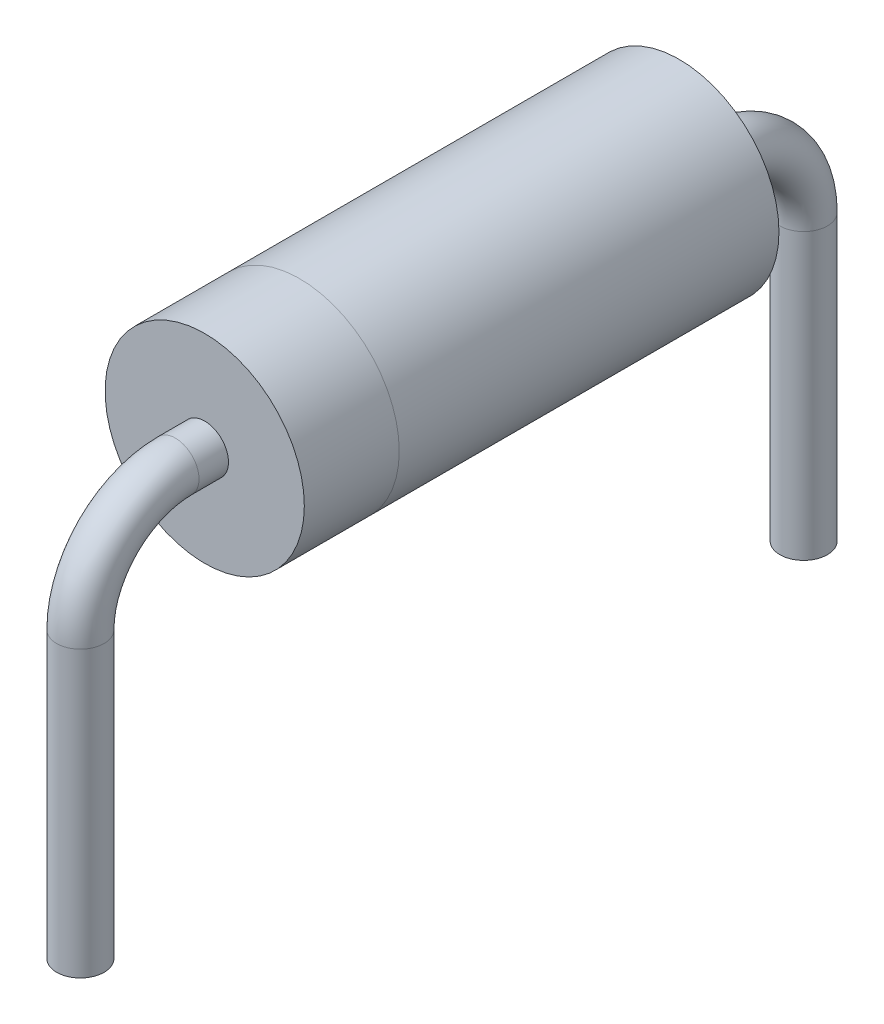
ISO-10303-21;
HEADER;
FILE_DESCRIPTION(('STEP AP214'),'2;1');
FILE_NAME('part.step','',(''),(''),'','','');
FILE_SCHEMA(('AUTOMOTIVE_DESIGN { 1 0 10303 214 1 1 1 1 }'));
ENDSEC;
DATA;
#1=APPLICATION_CONTEXT('core data for automotive mechanical design processes');
#2=APPLICATION_PROTOCOL_DEFINITION('international standard','automotive_design',2000,#1);
#3=PRODUCT_CONTEXT('',#1,'mechanical');
#4=PRODUCT('Part','Part','',(#3));
#5=PRODUCT_RELATED_PRODUCT_CATEGORY('part','',(#4));
#6=PRODUCT_DEFINITION_FORMATION('','',#4);
#7=PRODUCT_DEFINITION_CONTEXT('part definition',#1,'design');
#8=PRODUCT_DEFINITION('design','',#6,#7);
#9=PRODUCT_DEFINITION_SHAPE('','',#8);
#10=(LENGTH_UNIT() NAMED_UNIT(*) SI_UNIT(.MILLI.,.METRE.));
#11=(NAMED_UNIT(*) PLANE_ANGLE_UNIT() SI_UNIT($,.RADIAN.));
#12=(NAMED_UNIT(*) SI_UNIT($,.STERADIAN.) SOLID_ANGLE_UNIT());
#13=UNCERTAINTY_MEASURE_WITH_UNIT(LENGTH_MEASURE(1.E-05),#10,'distance_accuracy_value','');
#14=(GEOMETRIC_REPRESENTATION_CONTEXT(3) GLOBAL_UNCERTAINTY_ASSIGNED_CONTEXT((#13)) GLOBAL_UNIT_ASSIGNED_CONTEXT((#10,
#11,#12)) REPRESENTATION_CONTEXT('',''));
#15=CARTESIAN_POINT('',(0.,0.,0.));
#16=DIRECTION('',(0.,0.,1.));
#17=DIRECTION('',(1.,0.,0.));
#18=AXIS2_PLACEMENT_3D('',#15,#16,#17);
#19=CARTESIAN_POINT('',(0.,0.,5.));
#20=DIRECTION('',(0.,0.,1.));
#21=DIRECTION('',(1.,0.,0.));
#22=AXIS2_PLACEMENT_3D('',#19,#20,#21);
#23=PLANE('',#22);
#24=CARTESIAN_POINT('',(0.,0.,5.));
#25=DIRECTION('',(0.,0.,1.));
#26=DIRECTION('',(1.,0.,0.));
#27=AXIS2_PLACEMENT_3D('',#24,#25,#26);
#28=CIRCLE('',#27,1.0495);
#29=CARTESIAN_POINT('',(1.0495,0.,5.));
#30=VERTEX_POINT('',#29);
#31=EDGE_CURVE('E47',#30,#30,#28,.T.);
#32=ORIENTED_EDGE('',*,*,#31,.T.);
#33=EDGE_LOOP('',(#32));
#34=FACE_BOUND('',#33,.T.);
#35=CARTESIAN_POINT('',(0.,0.,5.));
#36=DIRECTION('',(0.,0.,1.));
#37=DIRECTION('',(1.,0.,0.));
#38=AXIS2_PLACEMENT_3D('',#35,#36,#37);
#39=CIRCLE('',#38,0.25);
#40=CARTESIAN_POINT('',(0.25,0.,5.));
#41=VERTEX_POINT('',#40);
#42=EDGE_CURVE('E100',#41,#41,#39,.T.);
#43=ORIENTED_EDGE('',*,*,#42,.F.);
#44=EDGE_LOOP('',(#43));
#45=FACE_BOUND('',#44,.T.);
#46=ADVANCED_FACE('F32',(#34,#45),#23,.T.);
#47=CARTESIAN_POINT('',(0.,0.,4.));
#48=DIRECTION('',(0.,0.,-1.));
#49=DIRECTION('',(-1.,0.,0.));
#50=AXIS2_PLACEMENT_3D('',#47,#48,#49);
#51=CYLINDRICAL_SURFACE('',#50,1.05);
#52=CARTESIAN_POINT('',(0.,0.,4.));
#53=DIRECTION('',(0.,0.,1.));
#54=DIRECTION('',(1.,0.,0.));
#55=AXIS2_PLACEMENT_3D('',#52,#53,#54);
#56=CIRCLE('',#55,1.0495);
#57=CARTESIAN_POINT('',(1.0495,0.,4.));
#58=VERTEX_POINT('',#57);
#59=EDGE_CURVE('E10',#58,#58,#56,.T.);
#60=ORIENTED_EDGE('',*,*,#59,.F.);
#61=EDGE_LOOP('',(#60));
#62=FACE_BOUND('',#61,.T.);
#63=CARTESIAN_POINT('',(0.,0.,0.));
#64=DIRECTION('',(0.,0.,1.));
#65=DIRECTION('',(1.,0.,0.));
#66=AXIS2_PLACEMENT_3D('',#63,#64,#65);
#67=CIRCLE('',#66,1.05);
#68=CARTESIAN_POINT('',(1.05,0.,0.));
#69=VERTEX_POINT('',#68);
#70=EDGE_CURVE('E42',#69,#69,#67,.T.);
#71=ORIENTED_EDGE('',*,*,#70,.T.);
#72=EDGE_LOOP('',(#71));
#73=FACE_BOUND('',#72,.T.);
#74=ADVANCED_FACE('F34',(#62,#73),#51,.T.);
#75=CARTESIAN_POINT('',(0.,0.,0.));
#76=DIRECTION('',(0.,0.,1.));
#77=DIRECTION('',(1.,0.,0.));
#78=AXIS2_PLACEMENT_3D('',#75,#76,#77);
#79=PLANE('',#78);
#80=CARTESIAN_POINT('',(0.,0.,0.));
#81=DIRECTION('',(0.,0.,1.));
#82=DIRECTION('',(1.,0.,0.));
#83=AXIS2_PLACEMENT_3D('',#80,#81,#82);
#84=CIRCLE('',#83,0.25);
#85=CARTESIAN_POINT('',(0.25,0.,0.));
#86=VERTEX_POINT('',#85);
#87=EDGE_CURVE('E112',#86,#86,#84,.T.);
#88=ORIENTED_EDGE('',*,*,#87,.T.);
#89=EDGE_LOOP('',(#88));
#90=FACE_BOUND('',#89,.T.);
#91=ORIENTED_EDGE('',*,*,#70,.F.);
#92=EDGE_LOOP('',(#91));
#93=FACE_BOUND('',#92,.T.);
#94=ADVANCED_FACE('F60',(#90,#93),#79,.F.);
#95=CARTESIAN_POINT('',(0.,0.,5.));
#96=DIRECTION('',(0.,0.,-1.));
#97=DIRECTION('',(-1.,0.,0.));
#98=AXIS2_PLACEMENT_3D('',#95,#96,#97);
#99=CYLINDRICAL_SURFACE('',#98,1.0495);
#100=ORIENTED_EDGE('',*,*,#31,.F.);
#101=EDGE_LOOP('',(#100));
#102=FACE_BOUND('',#101,.T.);
#103=ORIENTED_EDGE('',*,*,#59,.T.);
#104=EDGE_LOOP('',(#103));
#105=FACE_BOUND('',#104,.T.);
#106=ADVANCED_FACE('F65',(#102,#105),#99,.T.);
#107=CARTESIAN_POINT('',(0.,-1.,6.31));
#108=DIRECTION('',(0.,-1.,0.));
#109=DIRECTION('',(0.,0.,-1.));
#110=AXIS2_PLACEMENT_3D('',#107,#108,#109);
#111=CYLINDRICAL_SURFACE('',#110,0.25);
#112=CARTESIAN_POINT('',(0.,-1.,6.31));
#113=DIRECTION('',(0.,-1.,0.));
#114=DIRECTION('',(1.,0.,0.));
#115=AXIS2_PLACEMENT_3D('',#112,#113,#114);
#116=CIRCLE('',#115,0.25);
#117=CARTESIAN_POINT('',(0.,-1.,6.56));
#118=VERTEX_POINT('',#117);
#119=EDGE_CURVE('E92',#118,#118,#116,.T.);
#120=ORIENTED_EDGE('',*,*,#119,.T.);
#121=EDGE_LOOP('',(#120));
#122=FACE_BOUND('',#121,.T.);
#123=CARTESIAN_POINT('',(0.,-4.,6.31));
#124=DIRECTION('',(0.,-1.,0.));
#125=DIRECTION('',(1.,0.,0.));
#126=AXIS2_PLACEMENT_3D('',#123,#124,#125);
#127=CIRCLE('',#126,0.25);
#128=CARTESIAN_POINT('',(0.25,-4.,6.31));
#129=VERTEX_POINT('',#128);
#130=EDGE_CURVE('E52',#129,#129,#127,.T.);
#131=ORIENTED_EDGE('',*,*,#130,.F.);
#132=EDGE_LOOP('',(#131));
#133=FACE_BOUND('',#132,.T.);
#134=ADVANCED_FACE('F73',(#122,#133),#111,.T.);
#135=CARTESIAN_POINT('',(0.,-1.,5.31));
#136=DIRECTION('',(1.,0.,0.));
#137=DIRECTION('',(0.,0.,-1.));
#138=AXIS2_PLACEMENT_3D('',#135,#136,#137);
#139=TOROIDAL_SURFACE('',#138,1.,0.25);
#140=CARTESIAN_POINT('',(0.,0.,5.31));
#141=DIRECTION('',(0.,0.,1.));
#142=DIRECTION('',(1.,0.,0.));
#143=AXIS2_PLACEMENT_3D('',#140,#141,#142);
#144=CIRCLE('',#143,0.25);
#145=CARTESIAN_POINT('',(0.,0.25,5.31));
#146=VERTEX_POINT('',#145);
#147=EDGE_CURVE('E97',#146,#146,#144,.T.);
#148=CARTESIAN_POINT('',(0.,-1.,5.31));
#149=DIRECTION('',(1.,0.,0.));
#150=DIRECTION('',(0.,0.,-1.));
#151=AXIS2_PLACEMENT_3D('',#148,#149,#150);
#152=CIRCLE('',#151,1.25);
#153=EDGE_CURVE('',#146,#118,#152,.T.);
#154=ORIENTED_EDGE('',*,*,#147,.T.);
#155=ORIENTED_EDGE('',*,*,#119,.F.);
#156=ORIENTED_EDGE('',*,*,#153,.T.);
#157=ORIENTED_EDGE('',*,*,#153,.F.);
#158=EDGE_LOOP('',(#154,#156,#155,#157));
#159=FACE_BOUND('',#158,.T.);
#160=ADVANCED_FACE('F81',(#159),#139,.T.);
#161=CARTESIAN_POINT('',(0.,0.,5.31));
#162=DIRECTION('',(0.,0.,-1.));
#163=DIRECTION('',(-1.,0.,0.));
#164=AXIS2_PLACEMENT_3D('',#161,#162,#163);
#165=CYLINDRICAL_SURFACE('',#164,0.25);
#166=ORIENTED_EDGE('',*,*,#147,.F.);
#167=EDGE_LOOP('',(#166));
#168=FACE_BOUND('',#167,.T.);
#169=ORIENTED_EDGE('',*,*,#42,.T.);
#170=EDGE_LOOP('',(#169));
#171=FACE_BOUND('',#170,.T.);
#172=ADVANCED_FACE('F87',(#168,#171),#165,.T.);
#173=CARTESIAN_POINT('',(0.,-4.,6.31));
#174=DIRECTION('',(0.,-1.,0.));
#175=DIRECTION('',(1.,0.,0.));
#176=AXIS2_PLACEMENT_3D('',#173,#174,#175);
#177=PLANE('',#176);
#178=ORIENTED_EDGE('',*,*,#130,.T.);
#179=EDGE_LOOP('',(#178));
#180=FACE_BOUND('',#179,.T.);
#181=ADVANCED_FACE('F130',(#180),#177,.T.);
#182=CARTESIAN_POINT('',(0.,-1.,-1.31));
#183=DIRECTION('',(0.,-1.,0.));
#184=DIRECTION('',(0.,0.,-1.));
#185=AXIS2_PLACEMENT_3D('',#182,#183,#184);
#186=CYLINDRICAL_SURFACE('',#185,0.25);
#187=CARTESIAN_POINT('',(0.,-1.,-1.31));
#188=DIRECTION('',(0.,1.,0.));
#189=DIRECTION('',(1.,0.,0.));
#190=AXIS2_PLACEMENT_3D('',#187,#188,#189);
#191=CIRCLE('',#190,0.25);
#192=CARTESIAN_POINT('',(0.,-1.,-1.56));
#193=VERTEX_POINT('',#192);
#194=EDGE_CURVE('E108',#193,#193,#191,.T.);
#195=ORIENTED_EDGE('',*,*,#194,.F.);
#196=EDGE_LOOP('',(#195));
#197=FACE_BOUND('',#196,.T.);
#198=CARTESIAN_POINT('',(0.,-4.,-1.31));
#199=DIRECTION('',(0.,1.,0.));
#200=DIRECTION('',(1.,0.,0.));
#201=AXIS2_PLACEMENT_3D('',#198,#199,#200);
#202=CIRCLE('',#201,0.25);
#203=CARTESIAN_POINT('',(0.25,-4.,-1.31));
#204=VERTEX_POINT('',#203);
#205=EDGE_CURVE('E103',#204,#204,#202,.T.);
#206=ORIENTED_EDGE('',*,*,#205,.T.);
#207=EDGE_LOOP('',(#206));
#208=FACE_BOUND('',#207,.T.);
#209=ADVANCED_FACE('F124',(#197,#208),#186,.T.);
#210=CARTESIAN_POINT('',(0.,-1.,-0.309999999999999));
#211=DIRECTION('',(-1.,0.,0.));
#212=DIRECTION('',(0.,0.,1.));
#213=AXIS2_PLACEMENT_3D('',#210,#211,#212);
#214=TOROIDAL_SURFACE('',#213,1.,0.25);
#215=CARTESIAN_POINT('',(0.,0.,-0.309999999999999));
#216=DIRECTION('',(0.,0.,1.));
#217=DIRECTION('',(1.,0.,0.));
#218=AXIS2_PLACEMENT_3D('',#215,#216,#217);
#219=CIRCLE('',#218,0.25);
#220=CARTESIAN_POINT('',(0.,0.25,-0.309999999999999));
#221=VERTEX_POINT('',#220);
#222=EDGE_CURVE('E111',#221,#221,#219,.T.);
#223=CARTESIAN_POINT('',(0.,-1.,-0.309999999999999));
#224=DIRECTION('',(-1.,0.,0.));
#225=DIRECTION('',(0.,0.,1.));
#226=AXIS2_PLACEMENT_3D('',#223,#224,#225);
#227=CIRCLE('',#226,1.25);
#228=EDGE_CURVE('',#221,#193,#227,.T.);
#229=ORIENTED_EDGE('',*,*,#222,.F.);
#230=ORIENTED_EDGE('',*,*,#194,.T.);
#231=ORIENTED_EDGE('',*,*,#228,.T.);
#232=ORIENTED_EDGE('',*,*,#228,.F.);
#233=EDGE_LOOP('',(#229,#231,#230,#232));
#234=FACE_BOUND('',#233,.T.);
#235=ADVANCED_FACE('F121',(#234),#214,.T.);
#236=CARTESIAN_POINT('',(0.,0.,-0.309999999999999));
#237=DIRECTION('',(0.,0.,1.));
#238=DIRECTION('',(1.,0.,0.));
#239=AXIS2_PLACEMENT_3D('',#236,#237,#238);
#240=CYLINDRICAL_SURFACE('',#239,0.25);
#241=ORIENTED_EDGE('',*,*,#222,.T.);
#242=EDGE_LOOP('',(#241));
#243=FACE_BOUND('',#242,.T.);
#244=ORIENTED_EDGE('',*,*,#87,.F.);
#245=EDGE_LOOP('',(#244));
#246=FACE_BOUND('',#245,.T.);
#247=ADVANCED_FACE('F118',(#243,#246),#240,.T.);
#248=CARTESIAN_POINT('',(0.,-4.,-1.31));
#249=DIRECTION('',(0.,-1.,0.));
#250=DIRECTION('',(1.,0.,0.));
#251=AXIS2_PLACEMENT_3D('',#248,#249,#250);
#252=PLANE('',#251);
#253=ORIENTED_EDGE('',*,*,#205,.F.);
#254=EDGE_LOOP('',(#253));
#255=FACE_BOUND('',#254,.T.);
#256=ADVANCED_FACE('F134',(#255),#252,.T.);
#257=CLOSED_SHELL('',(#46,#74,#94,#106,#134,#160,#172,#181,#209,#235,#247,#256));
#258=MANIFOLD_SOLID_BREP('B2',#257);
#259=ADVANCED_BREP_SHAPE_REPRESENTATION('',(#18,#258),#14);
#260=SHAPE_DEFINITION_REPRESENTATION(#9,#259);
ENDSEC;
END-ISO-10303-21;
